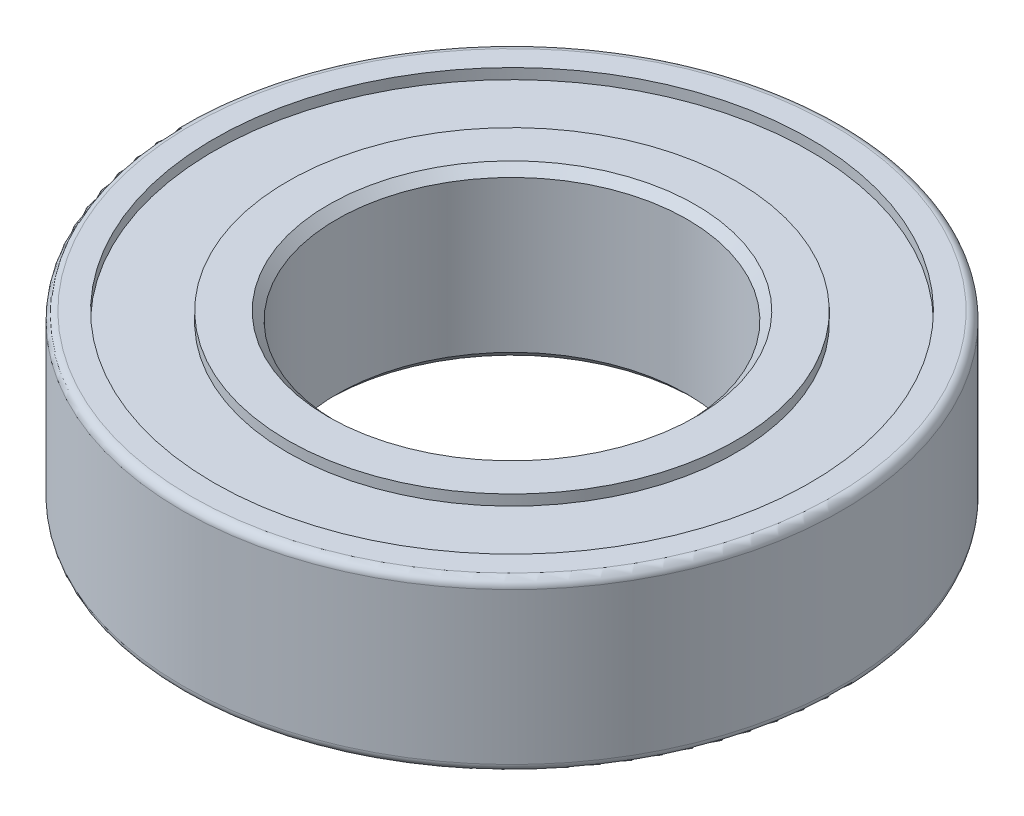
ISO-10303-21;
HEADER;
FILE_DESCRIPTION(('STEP AP214'),'2;1');
FILE_NAME('part.step','',(''),(''),'','','');
FILE_SCHEMA(('AUTOMOTIVE_DESIGN { 1 0 10303 214 1 1 1 1 }'));
ENDSEC;
DATA;
#1=APPLICATION_CONTEXT('core data for automotive mechanical design processes');
#2=APPLICATION_PROTOCOL_DEFINITION('international standard','automotive_design',2000,#1);
#3=PRODUCT_CONTEXT('',#1,'mechanical');
#4=PRODUCT('Part','Part','',(#3));
#5=PRODUCT_RELATED_PRODUCT_CATEGORY('part','',(#4));
#6=PRODUCT_DEFINITION_FORMATION('','',#4);
#7=PRODUCT_DEFINITION_CONTEXT('part definition',#1,'design');
#8=PRODUCT_DEFINITION('design','',#6,#7);
#9=PRODUCT_DEFINITION_SHAPE('','',#8);
#10=(LENGTH_UNIT() NAMED_UNIT(*) SI_UNIT(.MILLI.,.METRE.));
#11=(NAMED_UNIT(*) PLANE_ANGLE_UNIT() SI_UNIT($,.RADIAN.));
#12=(NAMED_UNIT(*) SI_UNIT($,.STERADIAN.) SOLID_ANGLE_UNIT());
#13=UNCERTAINTY_MEASURE_WITH_UNIT(LENGTH_MEASURE(1.E-05),#10,'distance_accuracy_value','');
#14=(GEOMETRIC_REPRESENTATION_CONTEXT(3) GLOBAL_UNCERTAINTY_ASSIGNED_CONTEXT((#13)) GLOBAL_UNIT_ASSIGNED_CONTEXT((#10,
#11,#12)) REPRESENTATION_CONTEXT('',''));
#15=CARTESIAN_POINT('',(0.,0.,0.));
#16=DIRECTION('',(0.,0.,1.));
#17=DIRECTION('',(1.,0.,0.));
#18=AXIS2_PLACEMENT_3D('',#15,#16,#17);
#19=CARTESIAN_POINT('',(0.,-5.4,0.));
#20=DIRECTION('',(0.,1.,0.));
#21=DIRECTION('',(0.,0.,1.));
#22=AXIS2_PLACEMENT_3D('',#19,#20,#21);
#23=TOROIDAL_SURFACE('',#22,22.9,0.6);
#24=CARTESIAN_POINT('',(0.,-6.00000000000001,0.));
#25=DIRECTION('',(0.,1.,0.));
#26=DIRECTION('',(0.,0.,1.));
#27=AXIS2_PLACEMENT_3D('',#24,#25,#26);
#28=CIRCLE('',#27,22.9);
#29=CARTESIAN_POINT('',(0.,-6.,22.9));
#30=VERTEX_POINT('',#29);
#31=EDGE_CURVE('E10',#30,#30,#28,.T.);
#32=ORIENTED_EDGE('',*,*,#31,.T.);
#33=EDGE_LOOP('',(#32));
#34=FACE_BOUND('',#33,.T.);
#35=CARTESIAN_POINT('',(0.,-5.4,0.));
#36=DIRECTION('',(0.,1.,0.));
#37=DIRECTION('',(0.,0.,1.));
#38=AXIS2_PLACEMENT_3D('',#35,#36,#37);
#39=CIRCLE('',#38,23.5);
#40=CARTESIAN_POINT('',(0.,-5.4,23.5));
#41=VERTEX_POINT('',#40);
#42=EDGE_CURVE('E80',#41,#41,#39,.T.);
#43=ORIENTED_EDGE('',*,*,#42,.F.);
#44=EDGE_LOOP('',(#43));
#45=FACE_BOUND('',#44,.T.);
#46=ADVANCED_FACE('F28',(#34,#45),#23,.T.);
#47=CARTESIAN_POINT('',(0.,-6.,22.9));
#48=DIRECTION('',(0.,-1.,0.));
#49=DIRECTION('',(0.,0.,-1.));
#50=AXIS2_PLACEMENT_3D('',#47,#48,#49);
#51=PLANE('',#50);
#52=CARTESIAN_POINT('',(0.,-6.00000000000001,0.));
#53=DIRECTION('',(0.,1.,0.));
#54=DIRECTION('',(0.,0.,1.));
#55=AXIS2_PLACEMENT_3D('',#52,#53,#54);
#56=CIRCLE('',#55,21.25);
#57=CARTESIAN_POINT('',(0.,-6.,21.25));
#58=VERTEX_POINT('',#57);
#59=EDGE_CURVE('E34',#58,#58,#56,.T.);
#60=ORIENTED_EDGE('',*,*,#59,.T.);
#61=EDGE_LOOP('',(#60));
#62=FACE_BOUND('',#61,.T.);
#63=ORIENTED_EDGE('',*,*,#31,.F.);
#64=EDGE_LOOP('',(#63));
#65=FACE_BOUND('',#64,.T.);
#66=ADVANCED_FACE('F88',(#62,#65),#51,.T.);
#67=CARTESIAN_POINT('',(0.,26.6806657171623,0.));
#68=DIRECTION('',(0.,1.,0.));
#69=DIRECTION('',(0.,0.,1.));
#70=AXIS2_PLACEMENT_3D('',#67,#68,#69);
#71=CYLINDRICAL_SURFACE('',#70,21.25);
#72=CARTESIAN_POINT('',(0.,-5.25,0.));
#73=DIRECTION('',(0.,1.,0.));
#74=DIRECTION('',(0.,0.,1.));
#75=AXIS2_PLACEMENT_3D('',#72,#73,#74);
#76=CIRCLE('',#75,21.25);
#77=CARTESIAN_POINT('',(0.,-5.25,21.25));
#78=VERTEX_POINT('',#77);
#79=EDGE_CURVE('E38',#78,#78,#76,.T.);
#80=ORIENTED_EDGE('',*,*,#79,.T.);
#81=EDGE_LOOP('',(#80));
#82=FACE_BOUND('',#81,.T.);
#83=ORIENTED_EDGE('',*,*,#59,.F.);
#84=EDGE_LOOP('',(#83));
#85=FACE_BOUND('',#84,.T.);
#86=ADVANCED_FACE('F92',(#82,#85),#71,.F.);
#87=CARTESIAN_POINT('',(0.,-5.25,21.25));
#88=DIRECTION('',(0.,-1.,0.));
#89=DIRECTION('',(0.,0.,-1.));
#90=AXIS2_PLACEMENT_3D('',#87,#88,#89);
#91=PLANE('',#90);
#92=CARTESIAN_POINT('',(0.,-5.25,0.));
#93=DIRECTION('',(0.,1.,0.));
#94=DIRECTION('',(0.,0.,1.));
#95=AXIS2_PLACEMENT_3D('',#92,#93,#94);
#96=CIRCLE('',#95,16.);
#97=CARTESIAN_POINT('',(0.,-5.25,16.));
#98=VERTEX_POINT('',#97);
#99=EDGE_CURVE('E42',#98,#98,#96,.T.);
#100=ORIENTED_EDGE('',*,*,#99,.T.);
#101=EDGE_LOOP('',(#100));
#102=FACE_BOUND('',#101,.T.);
#103=ORIENTED_EDGE('',*,*,#79,.F.);
#104=EDGE_LOOP('',(#103));
#105=FACE_BOUND('',#104,.T.);
#106=ADVANCED_FACE('F96',(#102,#105),#91,.T.);
#107=CARTESIAN_POINT('',(0.,26.6806657171623,0.));
#108=DIRECTION('',(0.,1.,0.));
#109=DIRECTION('',(0.,0.,1.));
#110=AXIS2_PLACEMENT_3D('',#107,#108,#109);
#111=CYLINDRICAL_SURFACE('',#110,16.);
#112=CARTESIAN_POINT('',(0.,-6.,0.));
#113=DIRECTION('',(0.,1.,0.));
#114=DIRECTION('',(0.,0.,1.));
#115=AXIS2_PLACEMENT_3D('',#112,#113,#114);
#116=CIRCLE('',#115,16.);
#117=CARTESIAN_POINT('',(0.,-6.,16.));
#118=VERTEX_POINT('',#117);
#119=EDGE_CURVE('E47',#118,#118,#116,.T.);
#120=ORIENTED_EDGE('',*,*,#119,.T.);
#121=EDGE_LOOP('',(#120));
#122=FACE_BOUND('',#121,.T.);
#123=ORIENTED_EDGE('',*,*,#99,.F.);
#124=EDGE_LOOP('',(#123));
#125=FACE_BOUND('',#124,.T.);
#126=ADVANCED_FACE('F103',(#122,#125),#111,.T.);
#127=CARTESIAN_POINT('',(0.,-6.,16.));
#128=DIRECTION('',(0.,-1.,0.));
#129=DIRECTION('',(0.,0.,-1.));
#130=AXIS2_PLACEMENT_3D('',#127,#128,#129);
#131=PLANE('',#130);
#132=CARTESIAN_POINT('',(0.,-6.00000000000001,0.));
#133=DIRECTION('',(0.,1.,0.));
#134=DIRECTION('',(0.,0.,1.));
#135=AXIS2_PLACEMENT_3D('',#132,#133,#134);
#136=CIRCLE('',#135,13.1);
#137=CARTESIAN_POINT('',(0.,-6.,13.1));
#138=VERTEX_POINT('',#137);
#139=EDGE_CURVE('E50',#138,#138,#136,.T.);
#140=ORIENTED_EDGE('',*,*,#139,.T.);
#141=EDGE_LOOP('',(#140));
#142=FACE_BOUND('',#141,.T.);
#143=ORIENTED_EDGE('',*,*,#119,.F.);
#144=EDGE_LOOP('',(#143));
#145=FACE_BOUND('',#144,.T.);
#146=ADVANCED_FACE('F107',(#142,#145),#131,.T.);
#147=CARTESIAN_POINT('',(0.,-6.00000000000001,0.));
#148=DIRECTION('',(0.,-1.,0.));
#149=DIRECTION('',(0.,0.,-1.));
#150=AXIS2_PLACEMENT_3D('',#147,#148,#149);
#151=CONICAL_SURFACE('',#150,13.1,0.785398163397447);
#152=CARTESIAN_POINT('',(0.,-5.4,0.));
#153=DIRECTION('',(0.,1.,0.));
#154=DIRECTION('',(0.,0.,1.));
#155=AXIS2_PLACEMENT_3D('',#152,#153,#154);
#156=CIRCLE('',#155,12.5);
#157=CARTESIAN_POINT('',(0.,-5.4,12.5));
#158=VERTEX_POINT('',#157);
#159=EDGE_CURVE('E53',#158,#158,#156,.T.);
#160=ORIENTED_EDGE('',*,*,#159,.T.);
#161=EDGE_LOOP('',(#160));
#162=FACE_BOUND('',#161,.T.);
#163=ORIENTED_EDGE('',*,*,#139,.F.);
#164=EDGE_LOOP('',(#163));
#165=FACE_BOUND('',#164,.T.);
#166=ADVANCED_FACE('F111',(#162,#165),#151,.F.);
#167=CARTESIAN_POINT('',(0.,26.6806657171623,0.));
#168=DIRECTION('',(0.,1.,0.));
#169=DIRECTION('',(0.,0.,1.));
#170=AXIS2_PLACEMENT_3D('',#167,#168,#169);
#171=CYLINDRICAL_SURFACE('',#170,12.5);
#172=CARTESIAN_POINT('',(0.,5.4,0.));
#173=DIRECTION('',(0.,1.,0.));
#174=DIRECTION('',(0.,0.,1.));
#175=AXIS2_PLACEMENT_3D('',#172,#173,#174);
#176=CIRCLE('',#175,12.5);
#177=CARTESIAN_POINT('',(0.,5.4,12.5));
#178=VERTEX_POINT('',#177);
#179=EDGE_CURVE('E56',#178,#178,#176,.T.);
#180=ORIENTED_EDGE('',*,*,#179,.T.);
#181=EDGE_LOOP('',(#180));
#182=FACE_BOUND('',#181,.T.);
#183=ORIENTED_EDGE('',*,*,#159,.F.);
#184=EDGE_LOOP('',(#183));
#185=FACE_BOUND('',#184,.T.);
#186=ADVANCED_FACE('F115',(#182,#185),#171,.F.);
#187=CARTESIAN_POINT('',(0.,5.4,0.));
#188=DIRECTION('',(0.,1.,0.));
#189=DIRECTION('',(0.,0.,1.));
#190=AXIS2_PLACEMENT_3D('',#187,#188,#189);
#191=CONICAL_SURFACE('',#190,12.5,0.785398163397451);
#192=CARTESIAN_POINT('',(0.,5.99999999999999,0.));
#193=DIRECTION('',(0.,1.,0.));
#194=DIRECTION('',(0.,0.,1.));
#195=AXIS2_PLACEMENT_3D('',#192,#193,#194);
#196=CIRCLE('',#195,13.1);
#197=CARTESIAN_POINT('',(0.,6.,13.1));
#198=VERTEX_POINT('',#197);
#199=EDGE_CURVE('E59',#198,#198,#196,.T.);
#200=ORIENTED_EDGE('',*,*,#199,.T.);
#201=EDGE_LOOP('',(#200));
#202=FACE_BOUND('',#201,.T.);
#203=ORIENTED_EDGE('',*,*,#179,.F.);
#204=EDGE_LOOP('',(#203));
#205=FACE_BOUND('',#204,.T.);
#206=ADVANCED_FACE('F119',(#202,#205),#191,.F.);
#207=CARTESIAN_POINT('',(0.,6.,16.));
#208=DIRECTION('',(0.,1.,0.));
#209=DIRECTION('',(0.,0.,1.));
#210=AXIS2_PLACEMENT_3D('',#207,#208,#209);
#211=PLANE('',#210);
#212=CARTESIAN_POINT('',(0.,5.99999999999999,0.));
#213=DIRECTION('',(0.,1.,0.));
#214=DIRECTION('',(0.,0.,1.));
#215=AXIS2_PLACEMENT_3D('',#212,#213,#214);
#216=CIRCLE('',#215,16.);
#217=CARTESIAN_POINT('',(0.,6.,16.));
#218=VERTEX_POINT('',#217);
#219=EDGE_CURVE('E62',#218,#218,#216,.T.);
#220=ORIENTED_EDGE('',*,*,#219,.T.);
#221=EDGE_LOOP('',(#220));
#222=FACE_BOUND('',#221,.T.);
#223=ORIENTED_EDGE('',*,*,#199,.F.);
#224=EDGE_LOOP('',(#223));
#225=FACE_BOUND('',#224,.T.);
#226=ADVANCED_FACE('F123',(#222,#225),#211,.T.);
#227=CARTESIAN_POINT('',(0.,26.6806657171623,0.));
#228=DIRECTION('',(0.,1.,0.));
#229=DIRECTION('',(0.,0.,1.));
#230=AXIS2_PLACEMENT_3D('',#227,#228,#229);
#231=CYLINDRICAL_SURFACE('',#230,16.);
#232=CARTESIAN_POINT('',(0.,5.24999999999999,0.));
#233=DIRECTION('',(0.,1.,0.));
#234=DIRECTION('',(0.,0.,1.));
#235=AXIS2_PLACEMENT_3D('',#232,#233,#234);
#236=CIRCLE('',#235,16.);
#237=CARTESIAN_POINT('',(0.,5.25,16.));
#238=VERTEX_POINT('',#237);
#239=EDGE_CURVE('E65',#238,#238,#236,.T.);
#240=ORIENTED_EDGE('',*,*,#239,.T.);
#241=EDGE_LOOP('',(#240));
#242=FACE_BOUND('',#241,.T.);
#243=ORIENTED_EDGE('',*,*,#219,.F.);
#244=EDGE_LOOP('',(#243));
#245=FACE_BOUND('',#244,.T.);
#246=ADVANCED_FACE('F127',(#242,#245),#231,.T.);
#247=CARTESIAN_POINT('',(0.,5.25,21.25));
#248=DIRECTION('',(0.,1.,0.));
#249=DIRECTION('',(0.,0.,1.));
#250=AXIS2_PLACEMENT_3D('',#247,#248,#249);
#251=PLANE('',#250);
#252=CARTESIAN_POINT('',(0.,5.24999999999999,0.));
#253=DIRECTION('',(0.,1.,0.));
#254=DIRECTION('',(0.,0.,1.));
#255=AXIS2_PLACEMENT_3D('',#252,#253,#254);
#256=CIRCLE('',#255,21.25);
#257=CARTESIAN_POINT('',(0.,5.25,21.25));
#258=VERTEX_POINT('',#257);
#259=EDGE_CURVE('E68',#258,#258,#256,.T.);
#260=ORIENTED_EDGE('',*,*,#259,.T.);
#261=EDGE_LOOP('',(#260));
#262=FACE_BOUND('',#261,.T.);
#263=ORIENTED_EDGE('',*,*,#239,.F.);
#264=EDGE_LOOP('',(#263));
#265=FACE_BOUND('',#264,.T.);
#266=ADVANCED_FACE('F131',(#262,#265),#251,.T.);
#267=CARTESIAN_POINT('',(0.,26.6806657171623,0.));
#268=DIRECTION('',(0.,1.,0.));
#269=DIRECTION('',(0.,0.,1.));
#270=AXIS2_PLACEMENT_3D('',#267,#268,#269);
#271=CYLINDRICAL_SURFACE('',#270,21.25);
#272=CARTESIAN_POINT('',(0.,5.99999999999999,0.));
#273=DIRECTION('',(0.,1.,0.));
#274=DIRECTION('',(0.,0.,1.));
#275=AXIS2_PLACEMENT_3D('',#272,#273,#274);
#276=CIRCLE('',#275,21.25);
#277=CARTESIAN_POINT('',(0.,6.,21.25));
#278=VERTEX_POINT('',#277);
#279=EDGE_CURVE('E71',#278,#278,#276,.T.);
#280=ORIENTED_EDGE('',*,*,#279,.T.);
#281=EDGE_LOOP('',(#280));
#282=FACE_BOUND('',#281,.T.);
#283=ORIENTED_EDGE('',*,*,#259,.F.);
#284=EDGE_LOOP('',(#283));
#285=FACE_BOUND('',#284,.T.);
#286=ADVANCED_FACE('F135',(#282,#285),#271,.F.);
#287=CARTESIAN_POINT('',(0.,6.,22.9));
#288=DIRECTION('',(0.,1.,0.));
#289=DIRECTION('',(0.,0.,1.));
#290=AXIS2_PLACEMENT_3D('',#287,#288,#289);
#291=PLANE('',#290);
#292=CARTESIAN_POINT('',(0.,5.99999999999999,0.));
#293=DIRECTION('',(0.,1.,0.));
#294=DIRECTION('',(0.,0.,1.));
#295=AXIS2_PLACEMENT_3D('',#292,#293,#294);
#296=CIRCLE('',#295,22.9);
#297=CARTESIAN_POINT('',(0.,6.,22.9));
#298=VERTEX_POINT('',#297);
#299=EDGE_CURVE('E74',#298,#298,#296,.T.);
#300=ORIENTED_EDGE('',*,*,#299,.T.);
#301=EDGE_LOOP('',(#300));
#302=FACE_BOUND('',#301,.T.);
#303=ORIENTED_EDGE('',*,*,#279,.F.);
#304=EDGE_LOOP('',(#303));
#305=FACE_BOUND('',#304,.T.);
#306=ADVANCED_FACE('F139',(#302,#305),#291,.T.);
#307=CARTESIAN_POINT('',(0.,5.39999999999999,0.));
#308=DIRECTION('',(0.,1.,0.));
#309=DIRECTION('',(0.,0.,1.));
#310=AXIS2_PLACEMENT_3D('',#307,#308,#309);
#311=TOROIDAL_SURFACE('',#310,22.9,0.6);
#312=CARTESIAN_POINT('',(0.,5.4,0.));
#313=DIRECTION('',(0.,1.,0.));
#314=DIRECTION('',(0.,0.,1.));
#315=AXIS2_PLACEMENT_3D('',#312,#313,#314);
#316=CIRCLE('',#315,23.5);
#317=CARTESIAN_POINT('',(0.,5.4,23.5));
#318=VERTEX_POINT('',#317);
#319=EDGE_CURVE('E77',#318,#318,#316,.T.);
#320=ORIENTED_EDGE('',*,*,#319,.T.);
#321=EDGE_LOOP('',(#320));
#322=FACE_BOUND('',#321,.T.);
#323=ORIENTED_EDGE('',*,*,#299,.F.);
#324=EDGE_LOOP('',(#323));
#325=FACE_BOUND('',#324,.T.);
#326=ADVANCED_FACE('F143',(#322,#325),#311,.T.);
#327=CARTESIAN_POINT('',(0.,26.6806657171623,0.));
#328=DIRECTION('',(0.,1.,0.));
#329=DIRECTION('',(0.,0.,1.));
#330=AXIS2_PLACEMENT_3D('',#327,#328,#329);
#331=CYLINDRICAL_SURFACE('',#330,23.5);
#332=ORIENTED_EDGE('',*,*,#42,.T.);
#333=EDGE_LOOP('',(#332));
#334=FACE_BOUND('',#333,.T.);
#335=ORIENTED_EDGE('',*,*,#319,.F.);
#336=EDGE_LOOP('',(#335));
#337=FACE_BOUND('',#336,.T.);
#338=ADVANCED_FACE('F84',(#334,#337),#331,.T.);
#339=CLOSED_SHELL('',(#46,#66,#86,#106,#126,#146,#166,#186,#206,#226,#246,#266,#286,#306,#326,#338));
#340=MANIFOLD_SOLID_BREP('B2',#339);
#341=ADVANCED_BREP_SHAPE_REPRESENTATION('',(#18,#340),#14);
#342=SHAPE_DEFINITION_REPRESENTATION(#9,#341);
ENDSEC;
END-ISO-10303-21;
